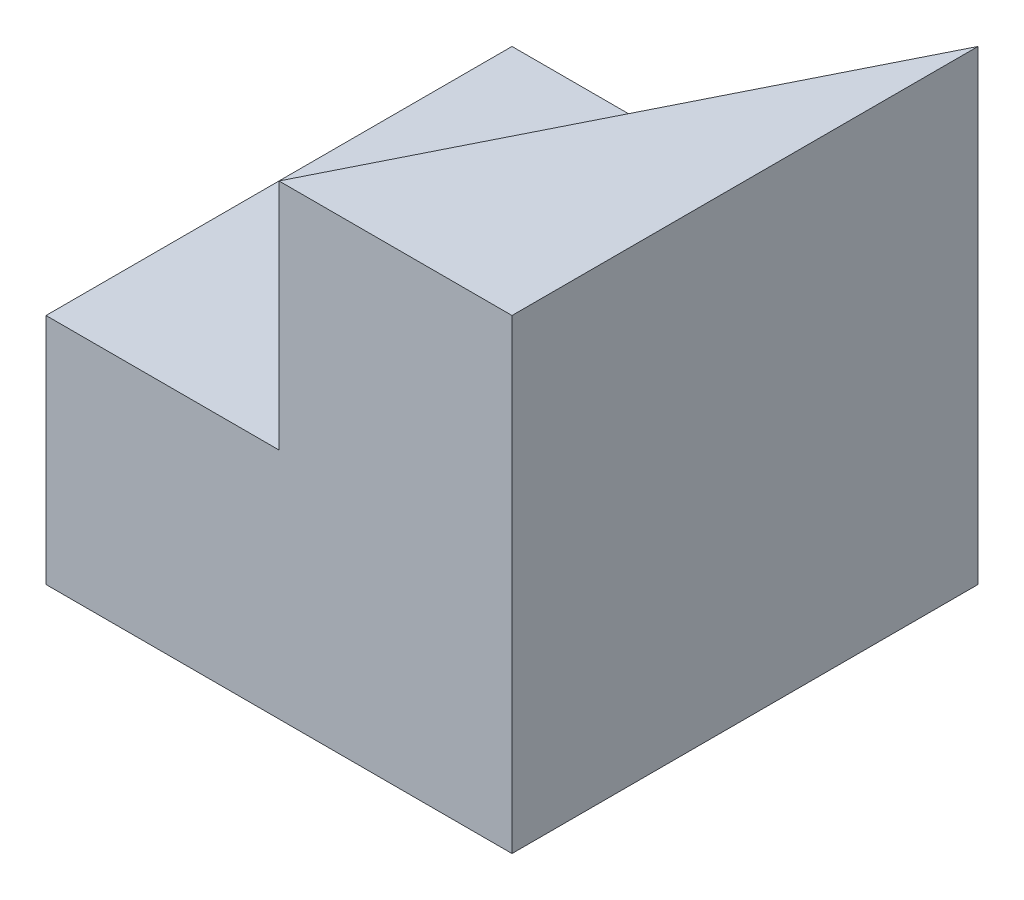
ISO-10303-21;
HEADER;
FILE_DESCRIPTION(('STEP AP214'),'2;1');
FILE_NAME('part.step','',(''),(''),'','','');
FILE_SCHEMA(('AUTOMOTIVE_DESIGN { 1 0 10303 214 1 1 1 1 }'));
ENDSEC;
DATA;
#1=APPLICATION_CONTEXT('core data for automotive mechanical design processes');
#2=APPLICATION_PROTOCOL_DEFINITION('international standard','automotive_design',2000,#1);
#3=PRODUCT_CONTEXT('',#1,'mechanical');
#4=PRODUCT('Part','Part','',(#3));
#5=PRODUCT_RELATED_PRODUCT_CATEGORY('part','',(#4));
#6=PRODUCT_DEFINITION_FORMATION('','',#4);
#7=PRODUCT_DEFINITION_CONTEXT('part definition',#1,'design');
#8=PRODUCT_DEFINITION('design','',#6,#7);
#9=PRODUCT_DEFINITION_SHAPE('','',#8);
#10=(LENGTH_UNIT() NAMED_UNIT(*) SI_UNIT(.MILLI.,.METRE.));
#11=(NAMED_UNIT(*) PLANE_ANGLE_UNIT() SI_UNIT($,.RADIAN.));
#12=(NAMED_UNIT(*) SI_UNIT($,.STERADIAN.) SOLID_ANGLE_UNIT());
#13=UNCERTAINTY_MEASURE_WITH_UNIT(LENGTH_MEASURE(1.E-05),#10,'distance_accuracy_value','');
#14=(GEOMETRIC_REPRESENTATION_CONTEXT(3) GLOBAL_UNCERTAINTY_ASSIGNED_CONTEXT((#13)) GLOBAL_UNIT_ASSIGNED_CONTEXT((#10,
#11,#12)) REPRESENTATION_CONTEXT('',''));
#15=CARTESIAN_POINT('',(0.,0.,0.));
#16=DIRECTION('',(0.,0.,1.));
#17=DIRECTION('',(1.,0.,0.));
#18=AXIS2_PLACEMENT_3D('',#15,#16,#17);
#19=CARTESIAN_POINT('',(0.,0.,40.));
#20=DIRECTION('',(1.,0.,0.));
#21=DIRECTION('',(0.,0.,-1.));
#22=AXIS2_PLACEMENT_3D('',#19,#20,#21);
#23=PLANE('',#22);
#24=DIRECTION('',(0.,-1.,0.));
#25=VECTOR('',#24,1.);
#26=CARTESIAN_POINT('',(0.,0.,40.));
#27=LINE('',#26,#25);
#28=CARTESIAN_POINT('',(0.,20.,40.));
#29=VERTEX_POINT('',#28);
#30=CARTESIAN_POINT('',(0.,0.,40.));
#31=VERTEX_POINT('',#30);
#32=EDGE_CURVE('E80',#29,#31,#27,.T.);
#33=ORIENTED_EDGE('',*,*,#32,.F.);
#34=DIRECTION('',(0.,0.,1.));
#35=VECTOR('',#34,1.);
#36=CARTESIAN_POINT('',(0.,20.,0.));
#37=LINE('',#36,#35);
#38=CARTESIAN_POINT('',(0.,20.,0.));
#39=VERTEX_POINT('',#38);
#40=EDGE_CURVE('E149',#39,#29,#37,.T.);
#41=ORIENTED_EDGE('',*,*,#40,.F.);
#42=DIRECTION('',(0.,-1.,0.));
#43=VECTOR('',#42,1.);
#44=CARTESIAN_POINT('',(0.,0.,0.));
#45=LINE('',#44,#43);
#46=CARTESIAN_POINT('',(0.,0.,0.));
#47=VERTEX_POINT('',#46);
#48=EDGE_CURVE('E61',#39,#47,#45,.T.);
#49=ORIENTED_EDGE('',*,*,#48,.T.);
#50=DIRECTION('',(0.,0.,-1.));
#51=VECTOR('',#50,1.);
#52=CARTESIAN_POINT('',(0.,0.,40.));
#53=LINE('',#52,#51);
#54=EDGE_CURVE('E11',#31,#47,#53,.T.);
#55=ORIENTED_EDGE('',*,*,#54,.F.);
#56=EDGE_LOOP('',(#33,#41,#49,#55));
#57=FACE_BOUND('',#56,.T.);
#58=ADVANCED_FACE('F33',(#57),#23,.F.);
#59=CARTESIAN_POINT('',(0.,0.,40.));
#60=DIRECTION('',(0.,1.,0.));
#61=DIRECTION('',(0.,0.,1.));
#62=AXIS2_PLACEMENT_3D('',#59,#60,#61);
#63=PLANE('',#62);
#64=DIRECTION('',(1.,0.,0.));
#65=VECTOR('',#64,1.);
#66=CARTESIAN_POINT('',(0.,0.,0.));
#67=LINE('',#66,#65);
#68=CARTESIAN_POINT('',(40.,0.,0.));
#69=VERTEX_POINT('',#68);
#70=EDGE_CURVE('E147',#47,#69,#67,.T.);
#71=ORIENTED_EDGE('',*,*,#70,.T.);
#72=DIRECTION('',(0.,0.,-1.));
#73=VECTOR('',#72,1.);
#74=CARTESIAN_POINT('',(40.,0.,40.));
#75=LINE('',#74,#73);
#76=CARTESIAN_POINT('',(40.,0.,40.));
#77=VERTEX_POINT('',#76);
#78=EDGE_CURVE('E41',#77,#69,#75,.T.);
#79=ORIENTED_EDGE('',*,*,#78,.F.);
#80=DIRECTION('',(1.,0.,0.));
#81=VECTOR('',#80,1.);
#82=CARTESIAN_POINT('',(0.,0.,40.));
#83=LINE('',#82,#81);
#84=EDGE_CURVE('E83',#31,#77,#83,.T.);
#85=ORIENTED_EDGE('',*,*,#84,.F.);
#86=ORIENTED_EDGE('',*,*,#54,.T.);
#87=EDGE_LOOP('',(#71,#79,#85,#86));
#88=FACE_BOUND('',#87,.T.);
#89=ADVANCED_FACE('F91',(#88),#63,.F.);
#90=CARTESIAN_POINT('',(40.,0.,40.));
#91=DIRECTION('',(-1.,0.,0.));
#92=DIRECTION('',(0.,0.,1.));
#93=AXIS2_PLACEMENT_3D('',#90,#91,#92);
#94=PLANE('',#93);
#95=DIRECTION('',(0.,1.,0.));
#96=VECTOR('',#95,1.);
#97=CARTESIAN_POINT('',(40.,0.,0.));
#98=LINE('',#97,#96);
#99=CARTESIAN_POINT('',(40.,20.,0.));
#100=VERTEX_POINT('',#99);
#101=EDGE_CURVE('E88',#69,#100,#98,.T.);
#102=ORIENTED_EDGE('',*,*,#101,.T.);
#103=DIRECTION('',(0.,1.,0.));
#104=VECTOR('',#103,1.);
#105=CARTESIAN_POINT('',(40.,20.,0.));
#106=LINE('',#105,#104);
#107=CARTESIAN_POINT('',(40.,40.,0.));
#108=VERTEX_POINT('',#107);
#109=EDGE_CURVE('E130',#100,#108,#106,.T.);
#110=ORIENTED_EDGE('',*,*,#109,.T.);
#111=DIRECTION('',(0.,0.,-1.));
#112=VECTOR('',#111,1.);
#113=CARTESIAN_POINT('',(40.,40.,40.));
#114=LINE('',#113,#112);
#115=CARTESIAN_POINT('',(40.,40.,40.));
#116=VERTEX_POINT('',#115);
#117=EDGE_CURVE('E139',#116,#108,#114,.T.);
#118=ORIENTED_EDGE('',*,*,#117,.F.);
#119=DIRECTION('',(0.,1.,0.));
#120=VECTOR('',#119,1.);
#121=CARTESIAN_POINT('',(40.,0.,40.));
#122=LINE('',#121,#120);
#123=EDGE_CURVE('E49',#77,#116,#122,.T.);
#124=ORIENTED_EDGE('',*,*,#123,.F.);
#125=ORIENTED_EDGE('',*,*,#78,.T.);
#126=EDGE_LOOP('',(#102,#110,#118,#124,#125));
#127=FACE_BOUND('',#126,.T.);
#128=ADVANCED_FACE('F98',(#127),#94,.F.);
#129=CARTESIAN_POINT('',(0.,40.,40.));
#130=DIRECTION('',(0.,-1.,0.));
#131=DIRECTION('',(0.,0.,-1.));
#132=AXIS2_PLACEMENT_3D('',#129,#130,#131);
#133=PLANE('',#132);
#134=ORIENTED_EDGE('',*,*,#117,.T.);
#135=DIRECTION('',(0.447213595499958,0.,-0.894427190999916));
#136=VECTOR('',#135,1.);
#137=CARTESIAN_POINT('',(20.,40.,40.));
#138=LINE('',#137,#136);
#139=CARTESIAN_POINT('',(20.,40.,40.));
#140=VERTEX_POINT('',#139);
#141=EDGE_CURVE('E127',#140,#108,#138,.T.);
#142=ORIENTED_EDGE('',*,*,#141,.F.);
#143=DIRECTION('',(-1.,0.,0.));
#144=VECTOR('',#143,1.);
#145=CARTESIAN_POINT('',(0.,40.,40.));
#146=LINE('',#145,#144);
#147=EDGE_CURVE('E142',#116,#140,#146,.T.);
#148=ORIENTED_EDGE('',*,*,#147,.F.);
#149=EDGE_LOOP('',(#134,#142,#148));
#150=FACE_BOUND('',#149,.T.);
#151=ADVANCED_FACE('F102',(#150),#133,.F.);
#152=CARTESIAN_POINT('',(0.,0.,40.));
#153=DIRECTION('',(0.,0.,-1.));
#154=DIRECTION('',(-1.,0.,0.));
#155=AXIS2_PLACEMENT_3D('',#152,#153,#154);
#156=PLANE('',#155);
#157=ORIENTED_EDGE('',*,*,#147,.T.);
#158=DIRECTION('',(0.,1.,0.));
#159=VECTOR('',#158,1.);
#160=CARTESIAN_POINT('',(20.,40.,40.));
#161=LINE('',#160,#159);
#162=CARTESIAN_POINT('',(20.,20.,40.));
#163=VERTEX_POINT('',#162);
#164=EDGE_CURVE('E132',#163,#140,#161,.T.);
#165=ORIENTED_EDGE('',*,*,#164,.F.);
#166=DIRECTION('',(1.,0.,0.));
#167=VECTOR('',#166,1.);
#168=CARTESIAN_POINT('',(0.,20.,40.));
#169=LINE('',#168,#167);
#170=EDGE_CURVE('E87',#29,#163,#169,.T.);
#171=ORIENTED_EDGE('',*,*,#170,.F.);
#172=ORIENTED_EDGE('',*,*,#32,.T.);
#173=ORIENTED_EDGE('',*,*,#84,.T.);
#174=ORIENTED_EDGE('',*,*,#123,.T.);
#175=EDGE_LOOP('',(#157,#165,#171,#172,#173,#174));
#176=FACE_BOUND('',#175,.T.);
#177=ADVANCED_FACE('F82',(#176),#156,.F.);
#178=CARTESIAN_POINT('',(0.,0.,0.));
#179=DIRECTION('',(0.,0.,-1.));
#180=DIRECTION('',(-1.,0.,0.));
#181=AXIS2_PLACEMENT_3D('',#178,#179,#180);
#182=PLANE('',#181);
#183=DIRECTION('',(1.,0.,0.));
#184=VECTOR('',#183,1.);
#185=CARTESIAN_POINT('',(0.,20.,0.));
#186=LINE('',#185,#184);
#187=EDGE_CURVE('E71',#39,#100,#186,.T.);
#188=ORIENTED_EDGE('',*,*,#187,.T.);
#189=ORIENTED_EDGE('',*,*,#101,.F.);
#190=ORIENTED_EDGE('',*,*,#70,.F.);
#191=ORIENTED_EDGE('',*,*,#48,.F.);
#192=EDGE_LOOP('',(#188,#189,#190,#191));
#193=FACE_BOUND('',#192,.T.);
#194=ADVANCED_FACE('F109',(#193),#182,.T.);
#195=CARTESIAN_POINT('',(0.,20.,0.));
#196=DIRECTION('',(0.,-1.,0.));
#197=DIRECTION('',(0.,0.,-1.));
#198=AXIS2_PLACEMENT_3D('',#195,#196,#197);
#199=PLANE('',#198);
#200=ORIENTED_EDGE('',*,*,#170,.T.);
#201=DIRECTION('',(0.447213595499958,0.,-0.894427190999916));
#202=VECTOR('',#201,1.);
#203=CARTESIAN_POINT('',(20.,20.,40.));
#204=LINE('',#203,#202);
#205=EDGE_CURVE('E136',#163,#100,#204,.T.);
#206=ORIENTED_EDGE('',*,*,#205,.T.);
#207=ORIENTED_EDGE('',*,*,#187,.F.);
#208=ORIENTED_EDGE('',*,*,#40,.T.);
#209=EDGE_LOOP('',(#200,#206,#207,#208));
#210=FACE_BOUND('',#209,.T.);
#211=ADVANCED_FACE('F112',(#210),#199,.F.);
#212=CARTESIAN_POINT('',(20.,20.,40.));
#213=DIRECTION('',(0.894427190999916,0.,0.447213595499958));
#214=DIRECTION('',(0.447213595499958,0.,-0.894427190999916));
#215=AXIS2_PLACEMENT_3D('',#212,#213,#214);
#216=PLANE('',#215);
#217=ORIENTED_EDGE('',*,*,#141,.T.);
#218=ORIENTED_EDGE('',*,*,#109,.F.);
#219=ORIENTED_EDGE('',*,*,#205,.F.);
#220=ORIENTED_EDGE('',*,*,#164,.T.);
#221=EDGE_LOOP('',(#217,#218,#219,#220));
#222=FACE_BOUND('',#221,.T.);
#223=ADVANCED_FACE('F118',(#222),#216,.F.);
#224=CLOSED_SHELL('',(#58,#89,#128,#151,#177,#194,#211,#223));
#225=MANIFOLD_SOLID_BREP('B2',#224);
#226=ADVANCED_BREP_SHAPE_REPRESENTATION('',(#18,#225),#14);
#227=SHAPE_DEFINITION_REPRESENTATION(#9,#226);
ENDSEC;
END-ISO-10303-21;
